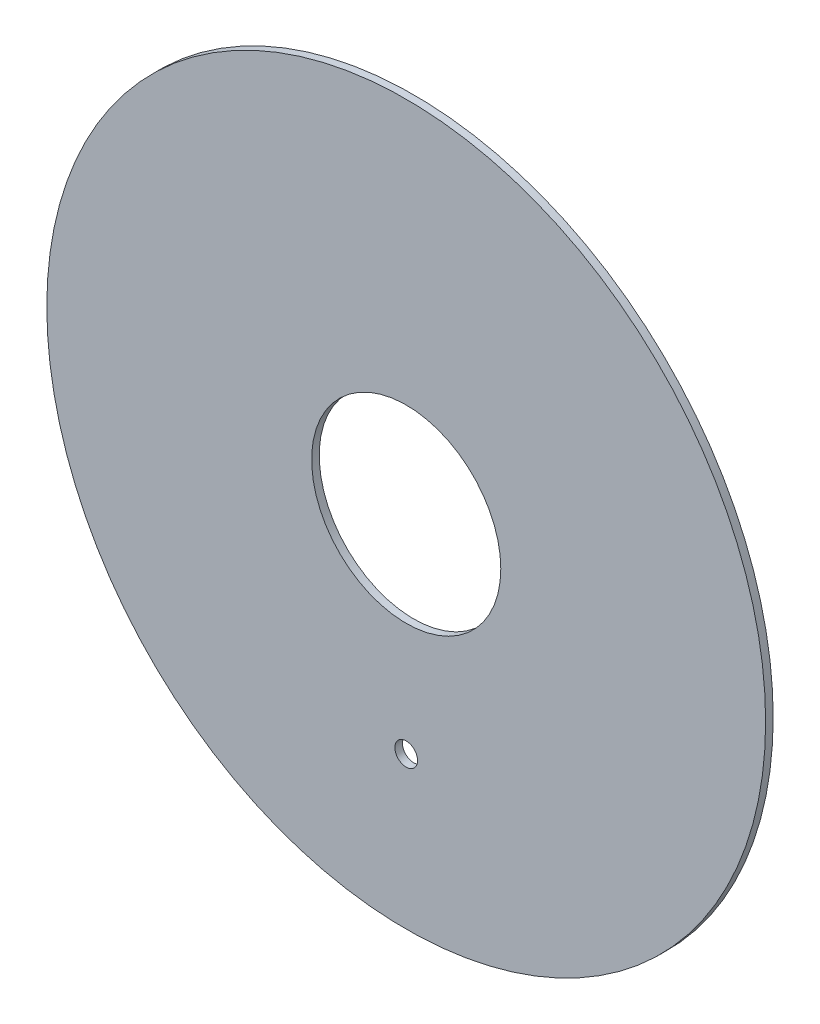
ISO-10303-21;
HEADER;
FILE_DESCRIPTION(('STEP AP214'),'2;1');
FILE_NAME('part.step','',(''),(''),'','','');
FILE_SCHEMA(('AUTOMOTIVE_DESIGN { 1 0 10303 214 1 1 1 1 }'));
ENDSEC;
DATA;
#1=APPLICATION_CONTEXT('core data for automotive mechanical design processes');
#2=APPLICATION_PROTOCOL_DEFINITION('international standard','automotive_design',2000,#1);
#3=PRODUCT_CONTEXT('',#1,'mechanical');
#4=PRODUCT('Part','Part','',(#3));
#5=PRODUCT_RELATED_PRODUCT_CATEGORY('part','',(#4));
#6=PRODUCT_DEFINITION_FORMATION('','',#4);
#7=PRODUCT_DEFINITION_CONTEXT('part definition',#1,'design');
#8=PRODUCT_DEFINITION('design','',#6,#7);
#9=PRODUCT_DEFINITION_SHAPE('','',#8);
#10=(LENGTH_UNIT() NAMED_UNIT(*) SI_UNIT(.MILLI.,.METRE.));
#11=(NAMED_UNIT(*) PLANE_ANGLE_UNIT() SI_UNIT($,.RADIAN.));
#12=(NAMED_UNIT(*) SI_UNIT($,.STERADIAN.) SOLID_ANGLE_UNIT());
#13=UNCERTAINTY_MEASURE_WITH_UNIT(LENGTH_MEASURE(1.E-05),#10,'distance_accuracy_value','');
#14=(GEOMETRIC_REPRESENTATION_CONTEXT(3) GLOBAL_UNCERTAINTY_ASSIGNED_CONTEXT((#13)) GLOBAL_UNIT_ASSIGNED_CONTEXT((#10,
#11,#12)) REPRESENTATION_CONTEXT('',''));
#15=CARTESIAN_POINT('',(0.,0.,0.));
#16=DIRECTION('',(0.,0.,1.));
#17=DIRECTION('',(1.,0.,0.));
#18=AXIS2_PLACEMENT_3D('',#15,#16,#17);
#19=CARTESIAN_POINT('',(0.,0.,1.));
#20=DIRECTION('',(0.,0.,1.));
#21=DIRECTION('',(1.,0.,0.));
#22=AXIS2_PLACEMENT_3D('',#19,#20,#21);
#23=PLANE('',#22);
#24=CARTESIAN_POINT('',(0.,-27.4538006887818,1.));
#25=DIRECTION('',(0.,0.,1.));
#26=DIRECTION('',(1.,0.,0.));
#27=AXIS2_PLACEMENT_3D('',#24,#25,#26);
#28=CIRCLE('',#27,1.5);
#29=CARTESIAN_POINT('',(1.5,-27.4538006887818,1.));
#30=VERTEX_POINT('',#29);
#31=EDGE_CURVE('E50',#30,#30,#28,.T.);
#32=ORIENTED_EDGE('',*,*,#31,.F.);
#33=EDGE_LOOP('',(#32));
#34=FACE_BOUND('',#33,.T.);
#35=CARTESIAN_POINT('',(0.,0.,1.));
#36=DIRECTION('',(0.,0.,1.));
#37=DIRECTION('',(1.,0.,0.));
#38=AXIS2_PLACEMENT_3D('',#35,#36,#37);
#39=CIRCLE('',#38,47.5);
#40=CARTESIAN_POINT('',(47.5,0.,1.));
#41=VERTEX_POINT('',#40);
#42=EDGE_CURVE('E10',#41,#41,#39,.T.);
#43=ORIENTED_EDGE('',*,*,#42,.T.);
#44=EDGE_LOOP('',(#43));
#45=FACE_BOUND('',#44,.T.);
#46=CARTESIAN_POINT('',(0.,0.,1.));
#47=DIRECTION('',(0.,0.,1.));
#48=DIRECTION('',(1.,0.,0.));
#49=AXIS2_PLACEMENT_3D('',#46,#47,#48);
#50=CIRCLE('',#49,12.5);
#51=CARTESIAN_POINT('',(12.5,0.,1.));
#52=VERTEX_POINT('',#51);
#53=EDGE_CURVE('E42',#52,#52,#50,.T.);
#54=ORIENTED_EDGE('',*,*,#53,.F.);
#55=EDGE_LOOP('',(#54));
#56=FACE_BOUND('',#55,.T.);
#57=ADVANCED_FACE('F31',(#34,#45,#56),#23,.T.);
#58=CARTESIAN_POINT('',(0.,0.,0.));
#59=DIRECTION('',(0.,0.,1.));
#60=DIRECTION('',(1.,0.,0.));
#61=AXIS2_PLACEMENT_3D('',#58,#59,#60);
#62=PLANE('',#61);
#63=CARTESIAN_POINT('',(0.,-27.4538006887818,0.));
#64=DIRECTION('',(0.,0.,1.));
#65=DIRECTION('',(1.,0.,0.));
#66=AXIS2_PLACEMENT_3D('',#63,#64,#65);
#67=CIRCLE('',#66,1.5);
#68=CARTESIAN_POINT('',(1.5,-27.4538006887818,0.));
#69=VERTEX_POINT('',#68);
#70=EDGE_CURVE('E47',#69,#69,#67,.T.);
#71=ORIENTED_EDGE('',*,*,#70,.T.);
#72=EDGE_LOOP('',(#71));
#73=FACE_BOUND('',#72,.T.);
#74=CARTESIAN_POINT('',(0.,0.,0.));
#75=DIRECTION('',(0.,0.,1.));
#76=DIRECTION('',(1.,0.,0.));
#77=AXIS2_PLACEMENT_3D('',#74,#75,#76);
#78=CIRCLE('',#77,47.5);
#79=CARTESIAN_POINT('',(47.5,0.,0.));
#80=VERTEX_POINT('',#79);
#81=EDGE_CURVE('E35',#80,#80,#78,.T.);
#82=ORIENTED_EDGE('',*,*,#81,.F.);
#83=EDGE_LOOP('',(#82));
#84=FACE_BOUND('',#83,.T.);
#85=CARTESIAN_POINT('',(0.,0.,0.));
#86=DIRECTION('',(0.,0.,1.));
#87=DIRECTION('',(1.,0.,0.));
#88=AXIS2_PLACEMENT_3D('',#85,#86,#87);
#89=CIRCLE('',#88,12.5);
#90=CARTESIAN_POINT('',(12.5,0.,0.));
#91=VERTEX_POINT('',#90);
#92=EDGE_CURVE('E44',#91,#91,#89,.T.);
#93=ORIENTED_EDGE('',*,*,#92,.T.);
#94=EDGE_LOOP('',(#93));
#95=FACE_BOUND('',#94,.T.);
#96=ADVANCED_FACE('F56',(#73,#84,#95),#62,.F.);
#97=CARTESIAN_POINT('',(0.,0.,1.));
#98=DIRECTION('',(0.,0.,-1.));
#99=DIRECTION('',(-1.,0.,0.));
#100=AXIS2_PLACEMENT_3D('',#97,#98,#99);
#101=CYLINDRICAL_SURFACE('',#100,47.5);
#102=ORIENTED_EDGE('',*,*,#42,.F.);
#103=EDGE_LOOP('',(#102));
#104=FACE_BOUND('',#103,.T.);
#105=ORIENTED_EDGE('',*,*,#81,.T.);
#106=EDGE_LOOP('',(#105));
#107=FACE_BOUND('',#106,.T.);
#108=ADVANCED_FACE('F33',(#104,#107),#101,.T.);
#109=CARTESIAN_POINT('',(0.,0.,1.));
#110=DIRECTION('',(0.,0.,-1.));
#111=DIRECTION('',(-1.,0.,0.));
#112=AXIS2_PLACEMENT_3D('',#109,#110,#111);
#113=CYLINDRICAL_SURFACE('',#112,12.5);
#114=ORIENTED_EDGE('',*,*,#53,.T.);
#115=EDGE_LOOP('',(#114));
#116=FACE_BOUND('',#115,.T.);
#117=ORIENTED_EDGE('',*,*,#92,.F.);
#118=EDGE_LOOP('',(#117));
#119=FACE_BOUND('',#118,.T.);
#120=ADVANCED_FACE('F62',(#116,#119),#113,.F.);
#121=CARTESIAN_POINT('',(0.,-27.4538006887818,0.));
#122=DIRECTION('',(0.,0.,1.));
#123=DIRECTION('',(1.,0.,0.));
#124=AXIS2_PLACEMENT_3D('',#121,#122,#123);
#125=CYLINDRICAL_SURFACE('',#124,1.5);
#126=ORIENTED_EDGE('',*,*,#70,.F.);
#127=EDGE_LOOP('',(#126));
#128=FACE_BOUND('',#127,.T.);
#129=ORIENTED_EDGE('',*,*,#31,.T.);
#130=EDGE_LOOP('',(#129));
#131=FACE_BOUND('',#130,.T.);
#132=ADVANCED_FACE('F59',(#128,#131),#125,.F.);
#133=CLOSED_SHELL('',(#57,#96,#108,#120,#132));
#134=MANIFOLD_SOLID_BREP('B2',#133);
#135=ADVANCED_BREP_SHAPE_REPRESENTATION('',(#18,#134),#14);
#136=SHAPE_DEFINITION_REPRESENTATION(#9,#135);
ENDSEC;
END-ISO-10303-21;
